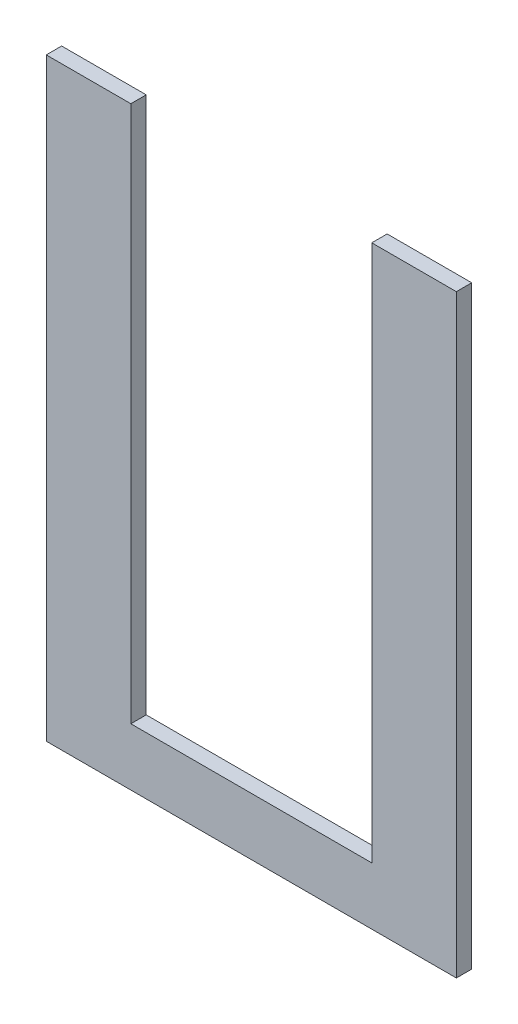
ISO-10303-21;
HEADER;
FILE_DESCRIPTION(('STEP AP214'),'2;1');
FILE_NAME('part.step','',(''),(''),'','','');
FILE_SCHEMA(('AUTOMOTIVE_DESIGN { 1 0 10303 214 1 1 1 1 }'));
ENDSEC;
DATA;
#1=APPLICATION_CONTEXT('core data for automotive mechanical design processes');
#2=APPLICATION_PROTOCOL_DEFINITION('international standard','automotive_design',2000,#1);
#3=PRODUCT_CONTEXT('',#1,'mechanical');
#4=PRODUCT('Part','Part','',(#3));
#5=PRODUCT_RELATED_PRODUCT_CATEGORY('part','',(#4));
#6=PRODUCT_DEFINITION_FORMATION('','',#4);
#7=PRODUCT_DEFINITION_CONTEXT('part definition',#1,'design');
#8=PRODUCT_DEFINITION('design','',#6,#7);
#9=PRODUCT_DEFINITION_SHAPE('','',#8);
#10=(LENGTH_UNIT() NAMED_UNIT(*) SI_UNIT(.MILLI.,.METRE.));
#11=(NAMED_UNIT(*) PLANE_ANGLE_UNIT() SI_UNIT($,.RADIAN.));
#12=(NAMED_UNIT(*) SI_UNIT($,.STERADIAN.) SOLID_ANGLE_UNIT());
#13=UNCERTAINTY_MEASURE_WITH_UNIT(LENGTH_MEASURE(1.E-05),#10,'distance_accuracy_value','');
#14=(GEOMETRIC_REPRESENTATION_CONTEXT(3) GLOBAL_UNCERTAINTY_ASSIGNED_CONTEXT((#13)) GLOBAL_UNIT_ASSIGNED_CONTEXT((#10,
#11,#12)) REPRESENTATION_CONTEXT('',''));
#15=CARTESIAN_POINT('',(0.,0.,0.));
#16=DIRECTION('',(0.,0.,1.));
#17=DIRECTION('',(1.,0.,0.));
#18=AXIS2_PLACEMENT_3D('',#15,#16,#17);
#19=CARTESIAN_POINT('',(0.,0.,-3.));
#20=DIRECTION('',(-1.,0.,0.));
#21=DIRECTION('',(0.,0.,1.));
#22=AXIS2_PLACEMENT_3D('',#19,#20,#21);
#23=PLANE('',#22);
#24=DIRECTION('',(0.,-1.,0.));
#25=VECTOR('',#24,1.);
#26=CARTESIAN_POINT('',(0.,0.,0.));
#27=LINE('',#26,#25);
#28=CARTESIAN_POINT('',(0.,115.957009142378,0.));
#29=VERTEX_POINT('',#28);
#30=CARTESIAN_POINT('',(0.,0.,0.));
#31=VERTEX_POINT('',#30);
#32=EDGE_CURVE('E130',#29,#31,#27,.T.);
#33=ORIENTED_EDGE('',*,*,#32,.F.);
#34=DIRECTION('',(0.,0.,1.));
#35=VECTOR('',#34,1.);
#36=CARTESIAN_POINT('',(0.,115.957009142378,-3.));
#37=LINE('',#36,#35);
#38=CARTESIAN_POINT('',(0.,115.957009142378,-3.));
#39=VERTEX_POINT('',#38);
#40=EDGE_CURVE('E11',#39,#29,#37,.T.);
#41=ORIENTED_EDGE('',*,*,#40,.F.);
#42=DIRECTION('',(0.,-1.,0.));
#43=VECTOR('',#42,1.);
#44=CARTESIAN_POINT('',(0.,0.,-3.));
#45=LINE('',#44,#43);
#46=CARTESIAN_POINT('',(0.,0.,-3.));
#47=VERTEX_POINT('',#46);
#48=EDGE_CURVE('E150',#39,#47,#45,.T.);
#49=ORIENTED_EDGE('',*,*,#48,.T.);
#50=DIRECTION('',(0.,0.,1.));
#51=VECTOR('',#50,1.);
#52=CARTESIAN_POINT('',(0.,0.,-3.));
#53=LINE('',#52,#51);
#54=EDGE_CURVE('E36',#47,#31,#53,.T.);
#55=ORIENTED_EDGE('',*,*,#54,.T.);
#56=EDGE_LOOP('',(#33,#41,#49,#55));
#57=FACE_BOUND('',#56,.T.);
#58=ADVANCED_FACE('F33',(#57),#23,.T.);
#59=CARTESIAN_POINT('',(0.,115.957009142378,-3.));
#60=DIRECTION('',(0.,1.,0.));
#61=DIRECTION('',(0.,0.,1.));
#62=AXIS2_PLACEMENT_3D('',#59,#60,#61);
#63=PLANE('',#62);
#64=DIRECTION('',(-1.,0.,0.));
#65=VECTOR('',#64,1.);
#66=CARTESIAN_POINT('',(0.,115.957009142378,0.));
#67=LINE('',#66,#65);
#68=CARTESIAN_POINT('',(16.5,115.957009142378,0.));
#69=VERTEX_POINT('',#68);
#70=EDGE_CURVE('E148',#69,#29,#67,.T.);
#71=ORIENTED_EDGE('',*,*,#70,.F.);
#72=DIRECTION('',(0.,0.,1.));
#73=VECTOR('',#72,1.);
#74=CARTESIAN_POINT('',(16.5,115.957009142378,-3.));
#75=LINE('',#74,#73);
#76=CARTESIAN_POINT('',(16.5,115.957009142378,-3.));
#77=VERTEX_POINT('',#76);
#78=EDGE_CURVE('E42',#77,#69,#75,.T.);
#79=ORIENTED_EDGE('',*,*,#78,.F.);
#80=DIRECTION('',(-1.,0.,0.));
#81=VECTOR('',#80,1.);
#82=CARTESIAN_POINT('',(0.,115.957009142378,-3.));
#83=LINE('',#82,#81);
#84=EDGE_CURVE('E120',#77,#39,#83,.T.);
#85=ORIENTED_EDGE('',*,*,#84,.T.);
#86=ORIENTED_EDGE('',*,*,#40,.T.);
#87=EDGE_LOOP('',(#71,#79,#85,#86));
#88=FACE_BOUND('',#87,.T.);
#89=ADVANCED_FACE('F162',(#88),#63,.T.);
#90=CARTESIAN_POINT('',(16.5,115.957009142378,-3.));
#91=DIRECTION('',(1.,0.,0.));
#92=DIRECTION('',(0.,1.,0.));
#93=AXIS2_PLACEMENT_3D('',#90,#91,#92);
#94=PLANE('',#93);
#95=DIRECTION('',(0.,1.,0.));
#96=VECTOR('',#95,1.);
#97=CARTESIAN_POINT('',(16.5,115.957009142378,0.));
#98=LINE('',#97,#96);
#99=CARTESIAN_POINT('',(16.5,11.2,0.));
#100=VERTEX_POINT('',#99);
#101=EDGE_CURVE('E107',#100,#69,#98,.T.);
#102=ORIENTED_EDGE('',*,*,#101,.F.);
#103=DIRECTION('',(0.,0.,1.));
#104=VECTOR('',#103,1.);
#105=CARTESIAN_POINT('',(16.5,11.2,-3.));
#106=LINE('',#105,#104);
#107=CARTESIAN_POINT('',(16.5,11.2,-3.));
#108=VERTEX_POINT('',#107);
#109=EDGE_CURVE('E102',#108,#100,#106,.T.);
#110=ORIENTED_EDGE('',*,*,#109,.F.);
#111=DIRECTION('',(0.,1.,0.));
#112=VECTOR('',#111,1.);
#113=CARTESIAN_POINT('',(16.5,115.957009142378,-3.));
#114=LINE('',#113,#112);
#115=EDGE_CURVE('E105',#108,#77,#114,.T.);
#116=ORIENTED_EDGE('',*,*,#115,.T.);
#117=ORIENTED_EDGE('',*,*,#78,.T.);
#118=EDGE_LOOP('',(#102,#110,#116,#117));
#119=FACE_BOUND('',#118,.T.);
#120=ADVANCED_FACE('F104',(#119),#94,.T.);
#121=CARTESIAN_POINT('',(16.5,11.2,-3.));
#122=DIRECTION('',(0.,1.,0.));
#123=DIRECTION('',(-1.,0.,0.));
#124=AXIS2_PLACEMENT_3D('',#121,#122,#123);
#125=PLANE('',#124);
#126=DIRECTION('',(-1.,0.,0.));
#127=VECTOR('',#126,1.);
#128=CARTESIAN_POINT('',(16.5,11.2,0.));
#129=LINE('',#128,#127);
#130=CARTESIAN_POINT('',(63.5000000000001,11.2,0.));
#131=VERTEX_POINT('',#130);
#132=EDGE_CURVE('E145',#131,#100,#129,.T.);
#133=ORIENTED_EDGE('',*,*,#132,.F.);
#134=DIRECTION('',(0.,0.,1.));
#135=VECTOR('',#134,1.);
#136=CARTESIAN_POINT('',(63.5000000000001,11.2,-3.));
#137=LINE('',#136,#135);
#138=CARTESIAN_POINT('',(63.5000000000001,11.2,-3.));
#139=VERTEX_POINT('',#138);
#140=EDGE_CURVE('E112',#139,#131,#137,.T.);
#141=ORIENTED_EDGE('',*,*,#140,.F.);
#142=DIRECTION('',(-1.,0.,0.));
#143=VECTOR('',#142,1.);
#144=CARTESIAN_POINT('',(16.5,11.2,-3.));
#145=LINE('',#144,#143);
#146=EDGE_CURVE('E118',#139,#108,#145,.T.);
#147=ORIENTED_EDGE('',*,*,#146,.T.);
#148=ORIENTED_EDGE('',*,*,#109,.T.);
#149=EDGE_LOOP('',(#133,#141,#147,#148));
#150=FACE_BOUND('',#149,.T.);
#151=ADVANCED_FACE('F122',(#150),#125,.T.);
#152=CARTESIAN_POINT('',(63.5000000000001,11.2,-3.));
#153=DIRECTION('',(-1.,0.,0.));
#154=DIRECTION('',(0.,-1.,0.));
#155=AXIS2_PLACEMENT_3D('',#152,#153,#154);
#156=PLANE('',#155);
#157=DIRECTION('',(0.,-1.,0.));
#158=VECTOR('',#157,1.);
#159=CARTESIAN_POINT('',(63.5000000000001,11.2,0.));
#160=LINE('',#159,#158);
#161=CARTESIAN_POINT('',(63.5,115.957009142378,0.));
#162=VERTEX_POINT('',#161);
#163=EDGE_CURVE('E142',#162,#131,#160,.T.);
#164=ORIENTED_EDGE('',*,*,#163,.F.);
#165=DIRECTION('',(0.,0.,1.));
#166=VECTOR('',#165,1.);
#167=CARTESIAN_POINT('',(63.5,115.957009142378,-3.));
#168=LINE('',#167,#166);
#169=CARTESIAN_POINT('',(63.5,115.957009142378,-3.));
#170=VERTEX_POINT('',#169);
#171=EDGE_CURVE('E154',#170,#162,#168,.T.);
#172=ORIENTED_EDGE('',*,*,#171,.F.);
#173=DIRECTION('',(0.,-1.,0.));
#174=VECTOR('',#173,1.);
#175=CARTESIAN_POINT('',(63.5000000000001,11.2,-3.));
#176=LINE('',#175,#174);
#177=EDGE_CURVE('E123',#170,#139,#176,.T.);
#178=ORIENTED_EDGE('',*,*,#177,.T.);
#179=ORIENTED_EDGE('',*,*,#140,.T.);
#180=EDGE_LOOP('',(#164,#172,#178,#179));
#181=FACE_BOUND('',#180,.T.);
#182=ADVANCED_FACE('F175',(#181),#156,.T.);
#183=CARTESIAN_POINT('',(63.5,115.957009142378,-3.));
#184=DIRECTION('',(0.,1.,0.));
#185=DIRECTION('',(0.,0.,1.));
#186=AXIS2_PLACEMENT_3D('',#183,#184,#185);
#187=PLANE('',#186);
#188=DIRECTION('',(-1.,0.,0.));
#189=VECTOR('',#188,1.);
#190=CARTESIAN_POINT('',(63.5,115.957009142378,0.));
#191=LINE('',#190,#189);
#192=CARTESIAN_POINT('',(80.,115.957009142378,0.));
#193=VERTEX_POINT('',#192);
#194=EDGE_CURVE('E139',#193,#162,#191,.T.);
#195=ORIENTED_EDGE('',*,*,#194,.F.);
#196=DIRECTION('',(0.,0.,1.));
#197=VECTOR('',#196,1.);
#198=CARTESIAN_POINT('',(80.,115.957009142378,-3.));
#199=LINE('',#198,#197);
#200=CARTESIAN_POINT('',(80.,115.957009142378,-3.));
#201=VERTEX_POINT('',#200);
#202=EDGE_CURVE('E156',#201,#193,#199,.T.);
#203=ORIENTED_EDGE('',*,*,#202,.F.);
#204=DIRECTION('',(-1.,0.,0.));
#205=VECTOR('',#204,1.);
#206=CARTESIAN_POINT('',(63.5,115.957009142378,-3.));
#207=LINE('',#206,#205);
#208=EDGE_CURVE('E125',#201,#170,#207,.T.);
#209=ORIENTED_EDGE('',*,*,#208,.T.);
#210=ORIENTED_EDGE('',*,*,#171,.T.);
#211=EDGE_LOOP('',(#195,#203,#209,#210));
#212=FACE_BOUND('',#211,.T.);
#213=ADVANCED_FACE('F178',(#212),#187,.T.);
#214=CARTESIAN_POINT('',(80.,0.,-3.));
#215=DIRECTION('',(1.,0.,0.));
#216=DIRECTION('',(0.,0.,-1.));
#217=AXIS2_PLACEMENT_3D('',#214,#215,#216);
#218=PLANE('',#217);
#219=DIRECTION('',(0.,1.,0.));
#220=VECTOR('',#219,1.);
#221=CARTESIAN_POINT('',(80.,0.,0.));
#222=LINE('',#221,#220);
#223=CARTESIAN_POINT('',(80.,0.,0.));
#224=VERTEX_POINT('',#223);
#225=EDGE_CURVE('E136',#224,#193,#222,.T.);
#226=ORIENTED_EDGE('',*,*,#225,.F.);
#227=DIRECTION('',(0.,0.,1.));
#228=VECTOR('',#227,1.);
#229=CARTESIAN_POINT('',(80.,0.,-3.));
#230=LINE('',#229,#228);
#231=CARTESIAN_POINT('',(80.,0.,-3.));
#232=VERTEX_POINT('',#231);
#233=EDGE_CURVE('E157',#232,#224,#230,.T.);
#234=ORIENTED_EDGE('',*,*,#233,.F.);
#235=DIRECTION('',(0.,1.,0.));
#236=VECTOR('',#235,1.);
#237=CARTESIAN_POINT('',(80.,0.,-3.));
#238=LINE('',#237,#236);
#239=EDGE_CURVE('E253',#232,#201,#238,.T.);
#240=ORIENTED_EDGE('',*,*,#239,.T.);
#241=ORIENTED_EDGE('',*,*,#202,.T.);
#242=EDGE_LOOP('',(#226,#234,#240,#241));
#243=FACE_BOUND('',#242,.T.);
#244=ADVANCED_FACE('F182',(#243),#218,.T.);
#245=CARTESIAN_POINT('',(0.,0.,-3.));
#246=DIRECTION('',(0.,-1.,0.));
#247=DIRECTION('',(0.,0.,-1.));
#248=AXIS2_PLACEMENT_3D('',#245,#246,#247);
#249=PLANE('',#248);
#250=DIRECTION('',(1.,0.,0.));
#251=VECTOR('',#250,1.);
#252=CARTESIAN_POINT('',(0.,0.,0.));
#253=LINE('',#252,#251);
#254=EDGE_CURVE('E133',#31,#224,#253,.T.);
#255=ORIENTED_EDGE('',*,*,#254,.F.);
#256=ORIENTED_EDGE('',*,*,#54,.F.);
#257=DIRECTION('',(1.,0.,0.));
#258=VECTOR('',#257,1.);
#259=CARTESIAN_POINT('',(0.,0.,-3.));
#260=LINE('',#259,#258);
#261=EDGE_CURVE('E254',#47,#232,#260,.T.);
#262=ORIENTED_EDGE('',*,*,#261,.T.);
#263=ORIENTED_EDGE('',*,*,#233,.T.);
#264=EDGE_LOOP('',(#255,#256,#262,#263));
#265=FACE_BOUND('',#264,.T.);
#266=ADVANCED_FACE('F159',(#265),#249,.T.);
#267=CARTESIAN_POINT('',(0.,0.,-3.));
#268=DIRECTION('',(0.,0.,-1.));
#269=DIRECTION('',(-1.,0.,0.));
#270=AXIS2_PLACEMENT_3D('',#267,#268,#269);
#271=PLANE('',#270);
#272=ORIENTED_EDGE('',*,*,#48,.F.);
#273=ORIENTED_EDGE('',*,*,#84,.F.);
#274=ORIENTED_EDGE('',*,*,#115,.F.);
#275=ORIENTED_EDGE('',*,*,#146,.F.);
#276=ORIENTED_EDGE('',*,*,#177,.F.);
#277=ORIENTED_EDGE('',*,*,#208,.F.);
#278=ORIENTED_EDGE('',*,*,#239,.F.);
#279=ORIENTED_EDGE('',*,*,#261,.F.);
#280=EDGE_LOOP('',(#272,#273,#274,#275,#276,#277,#278,#279));
#281=FACE_BOUND('',#280,.T.);
#282=ADVANCED_FACE('F116',(#281),#271,.T.);
#283=CARTESIAN_POINT('',(0.,0.,0.));
#284=DIRECTION('',(0.,0.,-1.));
#285=DIRECTION('',(-1.,0.,0.));
#286=AXIS2_PLACEMENT_3D('',#283,#284,#285);
#287=PLANE('',#286);
#288=ORIENTED_EDGE('',*,*,#32,.T.);
#289=ORIENTED_EDGE('',*,*,#254,.T.);
#290=ORIENTED_EDGE('',*,*,#225,.T.);
#291=ORIENTED_EDGE('',*,*,#194,.T.);
#292=ORIENTED_EDGE('',*,*,#163,.T.);
#293=ORIENTED_EDGE('',*,*,#132,.T.);
#294=ORIENTED_EDGE('',*,*,#101,.T.);
#295=ORIENTED_EDGE('',*,*,#70,.T.);
#296=EDGE_LOOP('',(#288,#289,#290,#291,#292,#293,#294,#295));
#297=FACE_BOUND('',#296,.T.);
#298=ADVANCED_FACE('F161',(#297),#287,.F.);
#299=CLOSED_SHELL('',(#58,#89,#120,#151,#182,#213,#244,#266,#282,#298));
#300=MANIFOLD_SOLID_BREP('B2',#299);
#301=ADVANCED_BREP_SHAPE_REPRESENTATION('',(#18,#300),#14);
#302=SHAPE_DEFINITION_REPRESENTATION(#9,#301);
ENDSEC;
END-ISO-10303-21;
